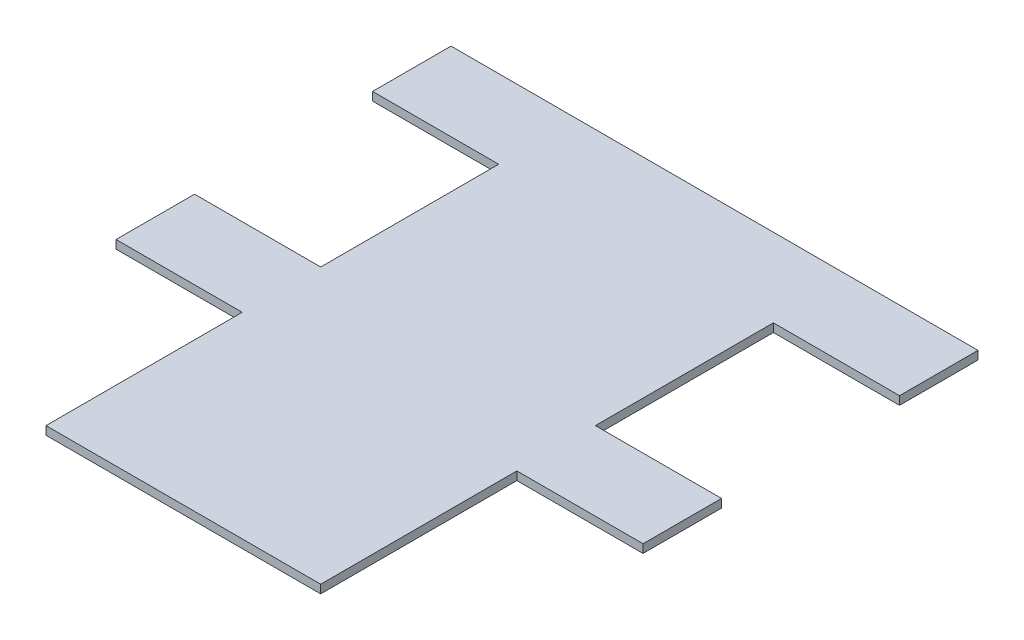
ISO-10303-21;
HEADER;
FILE_DESCRIPTION(('STEP AP214'),'2;1');
FILE_NAME('part.step','',(''),(''),'','','');
FILE_SCHEMA(('AUTOMOTIVE_DESIGN { 1 0 10303 214 1 1 1 1 }'));
ENDSEC;
DATA;
#1=APPLICATION_CONTEXT('core data for automotive mechanical design processes');
#2=APPLICATION_PROTOCOL_DEFINITION('international standard','automotive_design',2000,#1);
#3=PRODUCT_CONTEXT('',#1,'mechanical');
#4=PRODUCT('Part','Part','',(#3));
#5=PRODUCT_RELATED_PRODUCT_CATEGORY('part','',(#4));
#6=PRODUCT_DEFINITION_FORMATION('','',#4);
#7=PRODUCT_DEFINITION_CONTEXT('part definition',#1,'design');
#8=PRODUCT_DEFINITION('design','',#6,#7);
#9=PRODUCT_DEFINITION_SHAPE('','',#8);
#10=(LENGTH_UNIT() NAMED_UNIT(*) SI_UNIT(.MILLI.,.METRE.));
#11=(NAMED_UNIT(*) PLANE_ANGLE_UNIT() SI_UNIT($,.RADIAN.));
#12=(NAMED_UNIT(*) SI_UNIT($,.STERADIAN.) SOLID_ANGLE_UNIT());
#13=UNCERTAINTY_MEASURE_WITH_UNIT(LENGTH_MEASURE(1.E-05),#10,'distance_accuracy_value','');
#14=(GEOMETRIC_REPRESENTATION_CONTEXT(3) GLOBAL_UNCERTAINTY_ASSIGNED_CONTEXT((#13)) GLOBAL_UNIT_ASSIGNED_CONTEXT((#10,
#11,#12)) REPRESENTATION_CONTEXT('',''));
#15=CARTESIAN_POINT('',(0.,0.,0.));
#16=DIRECTION('',(0.,0.,1.));
#17=DIRECTION('',(1.,0.,0.));
#18=AXIS2_PLACEMENT_3D('',#15,#16,#17);
#19=CARTESIAN_POINT('',(71.5,1.5,-94.75));
#20=DIRECTION('',(0.,0.,1.));
#21=DIRECTION('',(1.,0.,0.));
#22=AXIS2_PLACEMENT_3D('',#19,#20,#21);
#23=PLANE('',#22);
#24=DIRECTION('',(-1.,0.,0.));
#25=VECTOR('',#24,1.);
#26=CARTESIAN_POINT('',(71.5,0.,-94.75));
#27=LINE('',#26,#25);
#28=CARTESIAN_POINT('',(71.5,0.,-94.75));
#29=VERTEX_POINT('',#28);
#30=CARTESIAN_POINT('',(-22.5,0.,-94.75));
#31=VERTEX_POINT('',#30);
#32=EDGE_CURVE('E179',#29,#31,#27,.T.);
#33=ORIENTED_EDGE('',*,*,#32,.T.);
#34=DIRECTION('',(0.,-1.,0.));
#35=VECTOR('',#34,1.);
#36=CARTESIAN_POINT('',(-22.5,1.5,-94.75));
#37=LINE('',#36,#35);
#38=CARTESIAN_POINT('',(-22.5,1.5,-94.75));
#39=VERTEX_POINT('',#38);
#40=EDGE_CURVE('E11',#39,#31,#37,.T.);
#41=ORIENTED_EDGE('',*,*,#40,.F.);
#42=DIRECTION('',(-1.,0.,0.));
#43=VECTOR('',#42,1.);
#44=CARTESIAN_POINT('',(71.5,1.5,-94.75));
#45=LINE('',#44,#43);
#46=CARTESIAN_POINT('',(71.5,1.5,-94.75));
#47=VERTEX_POINT('',#46);
#48=EDGE_CURVE('E209',#47,#39,#45,.T.);
#49=ORIENTED_EDGE('',*,*,#48,.F.);
#50=DIRECTION('',(0.,-1.,0.));
#51=VECTOR('',#50,1.);
#52=CARTESIAN_POINT('',(71.5,1.5,-94.75));
#53=LINE('',#52,#51);
#54=EDGE_CURVE('E175',#47,#29,#53,.T.);
#55=ORIENTED_EDGE('',*,*,#54,.T.);
#56=EDGE_LOOP('',(#33,#41,#49,#55));
#57=FACE_BOUND('',#56,.T.);
#58=ADVANCED_FACE('F35',(#57),#23,.F.);
#59=CARTESIAN_POINT('',(-22.5,1.5,-94.75));
#60=DIRECTION('',(1.,0.,0.));
#61=DIRECTION('',(0.,0.,-1.));
#62=AXIS2_PLACEMENT_3D('',#59,#60,#61);
#63=PLANE('',#62);
#64=DIRECTION('',(0.,0.,1.));
#65=VECTOR('',#64,1.);
#66=CARTESIAN_POINT('',(-22.5,0.,-94.75));
#67=LINE('',#66,#65);
#68=CARTESIAN_POINT('',(-22.5,0.,-80.75));
#69=VERTEX_POINT('',#68);
#70=EDGE_CURVE('E182',#31,#69,#67,.T.);
#71=ORIENTED_EDGE('',*,*,#70,.T.);
#72=DIRECTION('',(0.,-1.,0.));
#73=VECTOR('',#72,1.);
#74=CARTESIAN_POINT('',(-22.5,1.5,-80.75));
#75=LINE('',#74,#73);
#76=CARTESIAN_POINT('',(-22.5,1.5,-80.75));
#77=VERTEX_POINT('',#76);
#78=EDGE_CURVE('E43',#77,#69,#75,.T.);
#79=ORIENTED_EDGE('',*,*,#78,.F.);
#80=DIRECTION('',(0.,0.,1.));
#81=VECTOR('',#80,1.);
#82=CARTESIAN_POINT('',(-22.5,1.5,-94.75));
#83=LINE('',#82,#81);
#84=EDGE_CURVE('E118',#39,#77,#83,.T.);
#85=ORIENTED_EDGE('',*,*,#84,.F.);
#86=ORIENTED_EDGE('',*,*,#40,.T.);
#87=EDGE_LOOP('',(#71,#79,#85,#86));
#88=FACE_BOUND('',#87,.T.);
#89=ADVANCED_FACE('F307',(#88),#63,.F.);
#90=CARTESIAN_POINT('',(-22.5,1.5,-80.75));
#91=DIRECTION('',(0.,0.,-1.));
#92=DIRECTION('',(-1.,0.,0.));
#93=AXIS2_PLACEMENT_3D('',#90,#91,#92);
#94=PLANE('',#93);
#95=DIRECTION('',(1.,0.,0.));
#96=VECTOR('',#95,1.);
#97=CARTESIAN_POINT('',(-22.5,0.,-80.75));
#98=LINE('',#97,#96);
#99=CARTESIAN_POINT('',(0.,0.,-80.75));
#100=VERTEX_POINT('',#99);
#101=EDGE_CURVE('E184',#69,#100,#98,.T.);
#102=ORIENTED_EDGE('',*,*,#101,.T.);
#103=DIRECTION('',(0.,-1.,0.));
#104=VECTOR('',#103,1.);
#105=CARTESIAN_POINT('',(0.,1.5,-80.75));
#106=LINE('',#105,#104);
#107=CARTESIAN_POINT('',(0.,1.5,-80.75));
#108=VERTEX_POINT('',#107);
#109=EDGE_CURVE('E240',#108,#100,#106,.T.);
#110=ORIENTED_EDGE('',*,*,#109,.F.);
#111=DIRECTION('',(1.,0.,0.));
#112=VECTOR('',#111,1.);
#113=CARTESIAN_POINT('',(-22.5,1.5,-80.75));
#114=LINE('',#113,#112);
#115=EDGE_CURVE('E248',#77,#108,#114,.T.);
#116=ORIENTED_EDGE('',*,*,#115,.F.);
#117=ORIENTED_EDGE('',*,*,#78,.T.);
#118=EDGE_LOOP('',(#102,#110,#116,#117));
#119=FACE_BOUND('',#118,.T.);
#120=ADVANCED_FACE('F246',(#119),#94,.F.);
#121=CARTESIAN_POINT('',(0.,1.5,-80.75));
#122=DIRECTION('',(1.,0.,0.));
#123=DIRECTION('',(0.,0.,-1.));
#124=AXIS2_PLACEMENT_3D('',#121,#122,#123);
#125=PLANE('',#124);
#126=DIRECTION('',(0.,0.,1.));
#127=VECTOR('',#126,1.);
#128=CARTESIAN_POINT('',(0.,0.,-80.75));
#129=LINE('',#128,#127);
#130=CARTESIAN_POINT('',(0.,0.,-49.));
#131=VERTEX_POINT('',#130);
#132=EDGE_CURVE('E186',#100,#131,#129,.T.);
#133=ORIENTED_EDGE('',*,*,#132,.T.);
#134=DIRECTION('',(0.,-1.,0.));
#135=VECTOR('',#134,1.);
#136=CARTESIAN_POINT('',(0.,1.5,-49.));
#137=LINE('',#136,#135);
#138=CARTESIAN_POINT('',(0.,1.5,-49.));
#139=VERTEX_POINT('',#138);
#140=EDGE_CURVE('E237',#139,#131,#137,.T.);
#141=ORIENTED_EDGE('',*,*,#140,.F.);
#142=DIRECTION('',(0.,0.,1.));
#143=VECTOR('',#142,1.);
#144=CARTESIAN_POINT('',(0.,1.5,-80.75));
#145=LINE('',#144,#143);
#146=EDGE_CURVE('E266',#108,#139,#145,.T.);
#147=ORIENTED_EDGE('',*,*,#146,.F.);
#148=ORIENTED_EDGE('',*,*,#109,.T.);
#149=EDGE_LOOP('',(#133,#141,#147,#148));
#150=FACE_BOUND('',#149,.T.);
#151=ADVANCED_FACE('F257',(#150),#125,.F.);
#152=CARTESIAN_POINT('',(0.,1.5,-49.));
#153=DIRECTION('',(0.,0.,1.));
#154=DIRECTION('',(1.,0.,0.));
#155=AXIS2_PLACEMENT_3D('',#152,#153,#154);
#156=PLANE('',#155);
#157=DIRECTION('',(-1.,0.,0.));
#158=VECTOR('',#157,1.);
#159=CARTESIAN_POINT('',(0.,0.,-49.));
#160=LINE('',#159,#158);
#161=CARTESIAN_POINT('',(-22.5,0.,-49.));
#162=VERTEX_POINT('',#161);
#163=EDGE_CURVE('E188',#131,#162,#160,.T.);
#164=ORIENTED_EDGE('',*,*,#163,.T.);
#165=DIRECTION('',(0.,-1.,0.));
#166=VECTOR('',#165,1.);
#167=CARTESIAN_POINT('',(-22.5,1.5,-49.));
#168=LINE('',#167,#166);
#169=CARTESIAN_POINT('',(-22.5,1.5,-49.));
#170=VERTEX_POINT('',#169);
#171=EDGE_CURVE('E234',#170,#162,#168,.T.);
#172=ORIENTED_EDGE('',*,*,#171,.F.);
#173=DIRECTION('',(-1.,0.,0.));
#174=VECTOR('',#173,1.);
#175=CARTESIAN_POINT('',(0.,1.5,-49.));
#176=LINE('',#175,#174);
#177=EDGE_CURVE('E263',#139,#170,#176,.T.);
#178=ORIENTED_EDGE('',*,*,#177,.F.);
#179=ORIENTED_EDGE('',*,*,#140,.T.);
#180=EDGE_LOOP('',(#164,#172,#178,#179));
#181=FACE_BOUND('',#180,.T.);
#182=ADVANCED_FACE('F261',(#181),#156,.F.);
#183=CARTESIAN_POINT('',(-22.5,1.5,-49.));
#184=DIRECTION('',(1.,0.,0.));
#185=DIRECTION('',(0.,0.,-1.));
#186=AXIS2_PLACEMENT_3D('',#183,#184,#185);
#187=PLANE('',#186);
#188=DIRECTION('',(0.,0.,1.));
#189=VECTOR('',#188,1.);
#190=CARTESIAN_POINT('',(-22.5,0.,-49.));
#191=LINE('',#190,#189);
#192=CARTESIAN_POINT('',(-22.5,0.,-35.));
#193=VERTEX_POINT('',#192);
#194=EDGE_CURVE('E190',#162,#193,#191,.T.);
#195=ORIENTED_EDGE('',*,*,#194,.T.);
#196=DIRECTION('',(0.,-1.,0.));
#197=VECTOR('',#196,1.);
#198=CARTESIAN_POINT('',(-22.5,1.5,-35.));
#199=LINE('',#198,#197);
#200=CARTESIAN_POINT('',(-22.5,1.5,-35.));
#201=VERTEX_POINT('',#200);
#202=EDGE_CURVE('E231',#201,#193,#199,.T.);
#203=ORIENTED_EDGE('',*,*,#202,.F.);
#204=DIRECTION('',(0.,0.,1.));
#205=VECTOR('',#204,1.);
#206=CARTESIAN_POINT('',(-22.5,1.5,-49.));
#207=LINE('',#206,#205);
#208=EDGE_CURVE('E265',#170,#201,#207,.T.);
#209=ORIENTED_EDGE('',*,*,#208,.F.);
#210=ORIENTED_EDGE('',*,*,#171,.T.);
#211=EDGE_LOOP('',(#195,#203,#209,#210));
#212=FACE_BOUND('',#211,.T.);
#213=ADVANCED_FACE('F320',(#212),#187,.F.);
#214=CARTESIAN_POINT('',(-22.5,1.5,-35.));
#215=DIRECTION('',(0.,0.,-1.));
#216=DIRECTION('',(-1.,0.,0.));
#217=AXIS2_PLACEMENT_3D('',#214,#215,#216);
#218=PLANE('',#217);
#219=DIRECTION('',(1.,0.,0.));
#220=VECTOR('',#219,1.);
#221=CARTESIAN_POINT('',(-22.5,0.,-35.));
#222=LINE('',#221,#220);
#223=CARTESIAN_POINT('',(0.,0.,-35.));
#224=VERTEX_POINT('',#223);
#225=EDGE_CURVE('E192',#193,#224,#222,.T.);
#226=ORIENTED_EDGE('',*,*,#225,.T.);
#227=DIRECTION('',(0.,-1.,0.));
#228=VECTOR('',#227,1.);
#229=CARTESIAN_POINT('',(0.,1.5,-35.));
#230=LINE('',#229,#228);
#231=CARTESIAN_POINT('',(0.,1.5,-35.));
#232=VERTEX_POINT('',#231);
#233=EDGE_CURVE('E228',#232,#224,#230,.T.);
#234=ORIENTED_EDGE('',*,*,#233,.F.);
#235=DIRECTION('',(1.,0.,0.));
#236=VECTOR('',#235,1.);
#237=CARTESIAN_POINT('',(-22.5,1.5,-35.));
#238=LINE('',#237,#236);
#239=EDGE_CURVE('E268',#201,#232,#238,.T.);
#240=ORIENTED_EDGE('',*,*,#239,.F.);
#241=ORIENTED_EDGE('',*,*,#202,.T.);
#242=EDGE_LOOP('',(#226,#234,#240,#241));
#243=FACE_BOUND('',#242,.T.);
#244=ADVANCED_FACE('F323',(#243),#218,.F.);
#245=CARTESIAN_POINT('',(0.,1.5,-35.));
#246=DIRECTION('',(1.,0.,0.));
#247=DIRECTION('',(0.,0.,-1.));
#248=AXIS2_PLACEMENT_3D('',#245,#246,#247);
#249=PLANE('',#248);
#250=DIRECTION('',(0.,0.,1.));
#251=VECTOR('',#250,1.);
#252=CARTESIAN_POINT('',(0.,0.,-35.));
#253=LINE('',#252,#251);
#254=CARTESIAN_POINT('',(0.,0.,0.));
#255=VERTEX_POINT('',#254);
#256=EDGE_CURVE('E194',#224,#255,#253,.T.);
#257=ORIENTED_EDGE('',*,*,#256,.T.);
#258=DIRECTION('',(0.,-1.,0.));
#259=VECTOR('',#258,1.);
#260=CARTESIAN_POINT('',(0.,1.5,0.));
#261=LINE('',#260,#259);
#262=CARTESIAN_POINT('',(0.,1.5,0.));
#263=VERTEX_POINT('',#262);
#264=EDGE_CURVE('E225',#263,#255,#261,.T.);
#265=ORIENTED_EDGE('',*,*,#264,.F.);
#266=DIRECTION('',(0.,0.,1.));
#267=VECTOR('',#266,1.);
#268=CARTESIAN_POINT('',(0.,1.5,-35.));
#269=LINE('',#268,#267);
#270=EDGE_CURVE('E274',#232,#263,#269,.T.);
#271=ORIENTED_EDGE('',*,*,#270,.F.);
#272=ORIENTED_EDGE('',*,*,#233,.T.);
#273=EDGE_LOOP('',(#257,#265,#271,#272));
#274=FACE_BOUND('',#273,.T.);
#275=ADVANCED_FACE('F327',(#274),#249,.F.);
#276=CARTESIAN_POINT('',(0.,1.5,0.));
#277=DIRECTION('',(0.,0.,-1.));
#278=DIRECTION('',(-1.,0.,0.));
#279=AXIS2_PLACEMENT_3D('',#276,#277,#278);
#280=PLANE('',#279);
#281=DIRECTION('',(1.,0.,0.));
#282=VECTOR('',#281,1.);
#283=CARTESIAN_POINT('',(0.,0.,0.));
#284=LINE('',#283,#282);
#285=CARTESIAN_POINT('',(49.,0.,0.));
#286=VERTEX_POINT('',#285);
#287=EDGE_CURVE('E196',#255,#286,#284,.T.);
#288=ORIENTED_EDGE('',*,*,#287,.T.);
#289=DIRECTION('',(0.,-1.,0.));
#290=VECTOR('',#289,1.);
#291=CARTESIAN_POINT('',(49.,1.5,0.));
#292=LINE('',#291,#290);
#293=CARTESIAN_POINT('',(49.,1.5,0.));
#294=VERTEX_POINT('',#293);
#295=EDGE_CURVE('E222',#294,#286,#292,.T.);
#296=ORIENTED_EDGE('',*,*,#295,.F.);
#297=DIRECTION('',(1.,0.,0.));
#298=VECTOR('',#297,1.);
#299=CARTESIAN_POINT('',(0.,1.5,0.));
#300=LINE('',#299,#298);
#301=EDGE_CURVE('E276',#263,#294,#300,.T.);
#302=ORIENTED_EDGE('',*,*,#301,.F.);
#303=ORIENTED_EDGE('',*,*,#264,.T.);
#304=EDGE_LOOP('',(#288,#296,#302,#303));
#305=FACE_BOUND('',#304,.T.);
#306=ADVANCED_FACE('F331',(#305),#280,.F.);
#307=CARTESIAN_POINT('',(49.,1.5,0.));
#308=DIRECTION('',(-1.,0.,0.));
#309=DIRECTION('',(0.,0.,1.));
#310=AXIS2_PLACEMENT_3D('',#307,#308,#309);
#311=PLANE('',#310);
#312=DIRECTION('',(0.,0.,-1.));
#313=VECTOR('',#312,1.);
#314=CARTESIAN_POINT('',(49.,0.,0.));
#315=LINE('',#314,#313);
#316=CARTESIAN_POINT('',(49.,0.,-35.));
#317=VERTEX_POINT('',#316);
#318=EDGE_CURVE('E198',#286,#317,#315,.T.);
#319=ORIENTED_EDGE('',*,*,#318,.T.);
#320=DIRECTION('',(0.,-1.,0.));
#321=VECTOR('',#320,1.);
#322=CARTESIAN_POINT('',(49.,1.5,-35.));
#323=LINE('',#322,#321);
#324=CARTESIAN_POINT('',(49.,1.5,-35.));
#325=VERTEX_POINT('',#324);
#326=EDGE_CURVE('E219',#325,#317,#323,.T.);
#327=ORIENTED_EDGE('',*,*,#326,.F.);
#328=DIRECTION('',(0.,0.,-1.));
#329=VECTOR('',#328,1.);
#330=CARTESIAN_POINT('',(49.,1.5,0.));
#331=LINE('',#330,#329);
#332=EDGE_CURVE('E278',#294,#325,#331,.T.);
#333=ORIENTED_EDGE('',*,*,#332,.F.);
#334=ORIENTED_EDGE('',*,*,#295,.T.);
#335=EDGE_LOOP('',(#319,#327,#333,#334));
#336=FACE_BOUND('',#335,.T.);
#337=ADVANCED_FACE('F335',(#336),#311,.F.);
#338=CARTESIAN_POINT('',(49.,1.5,-35.));
#339=DIRECTION('',(0.,0.,-1.));
#340=DIRECTION('',(-1.,0.,0.));
#341=AXIS2_PLACEMENT_3D('',#338,#339,#340);
#342=PLANE('',#341);
#343=DIRECTION('',(1.,0.,0.));
#344=VECTOR('',#343,1.);
#345=CARTESIAN_POINT('',(49.,0.,-35.));
#346=LINE('',#345,#344);
#347=CARTESIAN_POINT('',(71.5,0.,-35.));
#348=VERTEX_POINT('',#347);
#349=EDGE_CURVE('E200',#317,#348,#346,.T.);
#350=ORIENTED_EDGE('',*,*,#349,.T.);
#351=DIRECTION('',(0.,-1.,0.));
#352=VECTOR('',#351,1.);
#353=CARTESIAN_POINT('',(71.5,1.5,-35.));
#354=LINE('',#353,#352);
#355=CARTESIAN_POINT('',(71.5,1.5,-35.));
#356=VERTEX_POINT('',#355);
#357=EDGE_CURVE('E216',#356,#348,#354,.T.);
#358=ORIENTED_EDGE('',*,*,#357,.F.);
#359=DIRECTION('',(1.,0.,0.));
#360=VECTOR('',#359,1.);
#361=CARTESIAN_POINT('',(49.,1.5,-35.));
#362=LINE('',#361,#360);
#363=EDGE_CURVE('E280',#325,#356,#362,.T.);
#364=ORIENTED_EDGE('',*,*,#363,.F.);
#365=ORIENTED_EDGE('',*,*,#326,.T.);
#366=EDGE_LOOP('',(#350,#358,#364,#365));
#367=FACE_BOUND('',#366,.T.);
#368=ADVANCED_FACE('F339',(#367),#342,.F.);
#369=CARTESIAN_POINT('',(71.5,1.5,-35.));
#370=DIRECTION('',(-1.,0.,0.));
#371=DIRECTION('',(0.,0.,1.));
#372=AXIS2_PLACEMENT_3D('',#369,#370,#371);
#373=PLANE('',#372);
#374=DIRECTION('',(0.,0.,-1.));
#375=VECTOR('',#374,1.);
#376=CARTESIAN_POINT('',(71.5,0.,-35.));
#377=LINE('',#376,#375);
#378=CARTESIAN_POINT('',(71.5,0.,-49.));
#379=VERTEX_POINT('',#378);
#380=EDGE_CURVE('E202',#348,#379,#377,.T.);
#381=ORIENTED_EDGE('',*,*,#380,.T.);
#382=DIRECTION('',(0.,-1.,0.));
#383=VECTOR('',#382,1.);
#384=CARTESIAN_POINT('',(71.5,1.5,-49.));
#385=LINE('',#384,#383);
#386=CARTESIAN_POINT('',(71.5,1.5,-49.));
#387=VERTEX_POINT('',#386);
#388=EDGE_CURVE('E213',#387,#379,#385,.T.);
#389=ORIENTED_EDGE('',*,*,#388,.F.);
#390=DIRECTION('',(0.,0.,-1.));
#391=VECTOR('',#390,1.);
#392=CARTESIAN_POINT('',(71.5,1.5,-35.));
#393=LINE('',#392,#391);
#394=EDGE_CURVE('E282',#356,#387,#393,.T.);
#395=ORIENTED_EDGE('',*,*,#394,.F.);
#396=ORIENTED_EDGE('',*,*,#357,.T.);
#397=EDGE_LOOP('',(#381,#389,#395,#396));
#398=FACE_BOUND('',#397,.T.);
#399=ADVANCED_FACE('F288',(#398),#373,.F.);
#400=CARTESIAN_POINT('',(71.5,1.5,-49.));
#401=DIRECTION('',(0.,0.,1.));
#402=DIRECTION('',(1.,0.,0.));
#403=AXIS2_PLACEMENT_3D('',#400,#401,#402);
#404=PLANE('',#403);
#405=DIRECTION('',(-1.,0.,0.));
#406=VECTOR('',#405,1.);
#407=CARTESIAN_POINT('',(71.5,0.,-49.));
#408=LINE('',#407,#406);
#409=CARTESIAN_POINT('',(49.,0.,-49.));
#410=VERTEX_POINT('',#409);
#411=EDGE_CURVE('E204',#379,#410,#408,.T.);
#412=ORIENTED_EDGE('',*,*,#411,.T.);
#413=DIRECTION('',(0.,-1.,0.));
#414=VECTOR('',#413,1.);
#415=CARTESIAN_POINT('',(49.,1.5,-49.));
#416=LINE('',#415,#414);
#417=CARTESIAN_POINT('',(49.,1.5,-49.));
#418=VERTEX_POINT('',#417);
#419=EDGE_CURVE('E170',#418,#410,#416,.T.);
#420=ORIENTED_EDGE('',*,*,#419,.F.);
#421=DIRECTION('',(-1.,0.,0.));
#422=VECTOR('',#421,1.);
#423=CARTESIAN_POINT('',(71.5,1.5,-49.));
#424=LINE('',#423,#422);
#425=EDGE_CURVE('E161',#387,#418,#424,.T.);
#426=ORIENTED_EDGE('',*,*,#425,.F.);
#427=ORIENTED_EDGE('',*,*,#388,.T.);
#428=EDGE_LOOP('',(#412,#420,#426,#427));
#429=FACE_BOUND('',#428,.T.);
#430=ADVANCED_FACE('F292',(#429),#404,.F.);
#431=CARTESIAN_POINT('',(49.,1.5,-49.));
#432=DIRECTION('',(-1.,0.,0.));
#433=DIRECTION('',(0.,0.,1.));
#434=AXIS2_PLACEMENT_3D('',#431,#432,#433);
#435=PLANE('',#434);
#436=DIRECTION('',(0.,0.,-1.));
#437=VECTOR('',#436,1.);
#438=CARTESIAN_POINT('',(49.,0.,-49.));
#439=LINE('',#438,#437);
#440=CARTESIAN_POINT('',(49.,0.,-80.75));
#441=VERTEX_POINT('',#440);
#442=EDGE_CURVE('E169',#410,#441,#439,.T.);
#443=ORIENTED_EDGE('',*,*,#442,.T.);
#444=DIRECTION('',(0.,-1.,0.));
#445=VECTOR('',#444,1.);
#446=CARTESIAN_POINT('',(49.,1.5,-80.75));
#447=LINE('',#446,#445);
#448=CARTESIAN_POINT('',(49.,1.5,-80.75));
#449=VERTEX_POINT('',#448);
#450=EDGE_CURVE('E166',#449,#441,#447,.T.);
#451=ORIENTED_EDGE('',*,*,#450,.F.);
#452=DIRECTION('',(0.,0.,-1.));
#453=VECTOR('',#452,1.);
#454=CARTESIAN_POINT('',(49.,1.5,-49.));
#455=LINE('',#454,#453);
#456=EDGE_CURVE('E155',#418,#449,#455,.T.);
#457=ORIENTED_EDGE('',*,*,#456,.F.);
#458=ORIENTED_EDGE('',*,*,#419,.T.);
#459=EDGE_LOOP('',(#443,#451,#457,#458));
#460=FACE_BOUND('',#459,.T.);
#461=ADVANCED_FACE('F167',(#460),#435,.F.);
#462=CARTESIAN_POINT('',(49.,1.5,-80.75));
#463=DIRECTION('',(0.,0.,-1.));
#464=DIRECTION('',(-1.,0.,0.));
#465=AXIS2_PLACEMENT_3D('',#462,#463,#464);
#466=PLANE('',#465);
#467=DIRECTION('',(1.,0.,0.));
#468=VECTOR('',#467,1.);
#469=CARTESIAN_POINT('',(49.,0.,-80.75));
#470=LINE('',#469,#468);
#471=CARTESIAN_POINT('',(71.5,0.,-80.75));
#472=VERTEX_POINT('',#471);
#473=EDGE_CURVE('E104',#441,#472,#470,.T.);
#474=ORIENTED_EDGE('',*,*,#473,.T.);
#475=DIRECTION('',(0.,-1.,0.));
#476=VECTOR('',#475,1.);
#477=CARTESIAN_POINT('',(71.5,1.5,-80.75));
#478=LINE('',#477,#476);
#479=CARTESIAN_POINT('',(71.5,1.5,-80.75));
#480=VERTEX_POINT('',#479);
#481=EDGE_CURVE('E171',#480,#472,#478,.T.);
#482=ORIENTED_EDGE('',*,*,#481,.F.);
#483=DIRECTION('',(1.,0.,0.));
#484=VECTOR('',#483,1.);
#485=CARTESIAN_POINT('',(49.,1.5,-80.75));
#486=LINE('',#485,#484);
#487=EDGE_CURVE('E159',#449,#480,#486,.T.);
#488=ORIENTED_EDGE('',*,*,#487,.F.);
#489=ORIENTED_EDGE('',*,*,#450,.T.);
#490=EDGE_LOOP('',(#474,#482,#488,#489));
#491=FACE_BOUND('',#490,.T.);
#492=ADVANCED_FACE('F173',(#491),#466,.F.);
#493=CARTESIAN_POINT('',(71.5,1.5,-80.75));
#494=DIRECTION('',(-1.,0.,0.));
#495=DIRECTION('',(0.,0.,1.));
#496=AXIS2_PLACEMENT_3D('',#493,#494,#495);
#497=PLANE('',#496);
#498=DIRECTION('',(0.,0.,-1.));
#499=VECTOR('',#498,1.);
#500=CARTESIAN_POINT('',(71.5,0.,-80.75));
#501=LINE('',#500,#499);
#502=EDGE_CURVE('E110',#472,#29,#501,.T.);
#503=ORIENTED_EDGE('',*,*,#502,.T.);
#504=ORIENTED_EDGE('',*,*,#54,.F.);
#505=DIRECTION('',(0.,0.,-1.));
#506=VECTOR('',#505,1.);
#507=CARTESIAN_POINT('',(71.5,1.5,-80.75));
#508=LINE('',#507,#506);
#509=EDGE_CURVE('E51',#480,#47,#508,.T.);
#510=ORIENTED_EDGE('',*,*,#509,.F.);
#511=ORIENTED_EDGE('',*,*,#481,.T.);
#512=EDGE_LOOP('',(#503,#504,#510,#511));
#513=FACE_BOUND('',#512,.T.);
#514=ADVANCED_FACE('F296',(#513),#497,.F.);
#515=CARTESIAN_POINT('',(0.,1.5,0.));
#516=DIRECTION('',(0.,1.,0.));
#517=DIRECTION('',(0.,0.,1.));
#518=AXIS2_PLACEMENT_3D('',#515,#516,#517);
#519=PLANE('',#518);
#520=ORIENTED_EDGE('',*,*,#48,.T.);
#521=ORIENTED_EDGE('',*,*,#84,.T.);
#522=ORIENTED_EDGE('',*,*,#115,.T.);
#523=ORIENTED_EDGE('',*,*,#146,.T.);
#524=ORIENTED_EDGE('',*,*,#177,.T.);
#525=ORIENTED_EDGE('',*,*,#208,.T.);
#526=ORIENTED_EDGE('',*,*,#239,.T.);
#527=ORIENTED_EDGE('',*,*,#270,.T.);
#528=ORIENTED_EDGE('',*,*,#301,.T.);
#529=ORIENTED_EDGE('',*,*,#332,.T.);
#530=ORIENTED_EDGE('',*,*,#363,.T.);
#531=ORIENTED_EDGE('',*,*,#394,.T.);
#532=ORIENTED_EDGE('',*,*,#425,.T.);
#533=ORIENTED_EDGE('',*,*,#456,.T.);
#534=ORIENTED_EDGE('',*,*,#487,.T.);
#535=ORIENTED_EDGE('',*,*,#509,.T.);
#536=EDGE_LOOP('',(#520,#521,#522,#523,#524,#525,#526,#527,#528,#529,#530,#531,#532,#533,#534,#535));
#537=FACE_BOUND('',#536,.T.);
#538=ADVANCED_FACE('F157',(#537),#519,.T.);
#539=CARTESIAN_POINT('',(0.,0.,0.));
#540=DIRECTION('',(0.,1.,0.));
#541=DIRECTION('',(0.,0.,1.));
#542=AXIS2_PLACEMENT_3D('',#539,#540,#541);
#543=PLANE('',#542);
#544=ORIENTED_EDGE('',*,*,#32,.F.);
#545=ORIENTED_EDGE('',*,*,#502,.F.);
#546=ORIENTED_EDGE('',*,*,#473,.F.);
#547=ORIENTED_EDGE('',*,*,#442,.F.);
#548=ORIENTED_EDGE('',*,*,#411,.F.);
#549=ORIENTED_EDGE('',*,*,#380,.F.);
#550=ORIENTED_EDGE('',*,*,#349,.F.);
#551=ORIENTED_EDGE('',*,*,#318,.F.);
#552=ORIENTED_EDGE('',*,*,#287,.F.);
#553=ORIENTED_EDGE('',*,*,#256,.F.);
#554=ORIENTED_EDGE('',*,*,#225,.F.);
#555=ORIENTED_EDGE('',*,*,#194,.F.);
#556=ORIENTED_EDGE('',*,*,#163,.F.);
#557=ORIENTED_EDGE('',*,*,#132,.F.);
#558=ORIENTED_EDGE('',*,*,#101,.F.);
#559=ORIENTED_EDGE('',*,*,#70,.F.);
#560=EDGE_LOOP('',(#544,#545,#546,#547,#548,#549,#550,#551,#552,#553,#554,#555,#556,#557,#558,#559));
#561=FACE_BOUND('',#560,.T.);
#562=ADVANCED_FACE('F252',(#561),#543,.F.);
#563=CLOSED_SHELL('',(#58,#89,#120,#151,#182,#213,#244,#275,#306,#337,#368,#399,#430,#461,#492,
#514,#538,#562));
#564=MANIFOLD_SOLID_BREP('B2',#563);
#565=ADVANCED_BREP_SHAPE_REPRESENTATION('',(#18,#564),#14);
#566=SHAPE_DEFINITION_REPRESENTATION(#9,#565);
ENDSEC;
END-ISO-10303-21;
